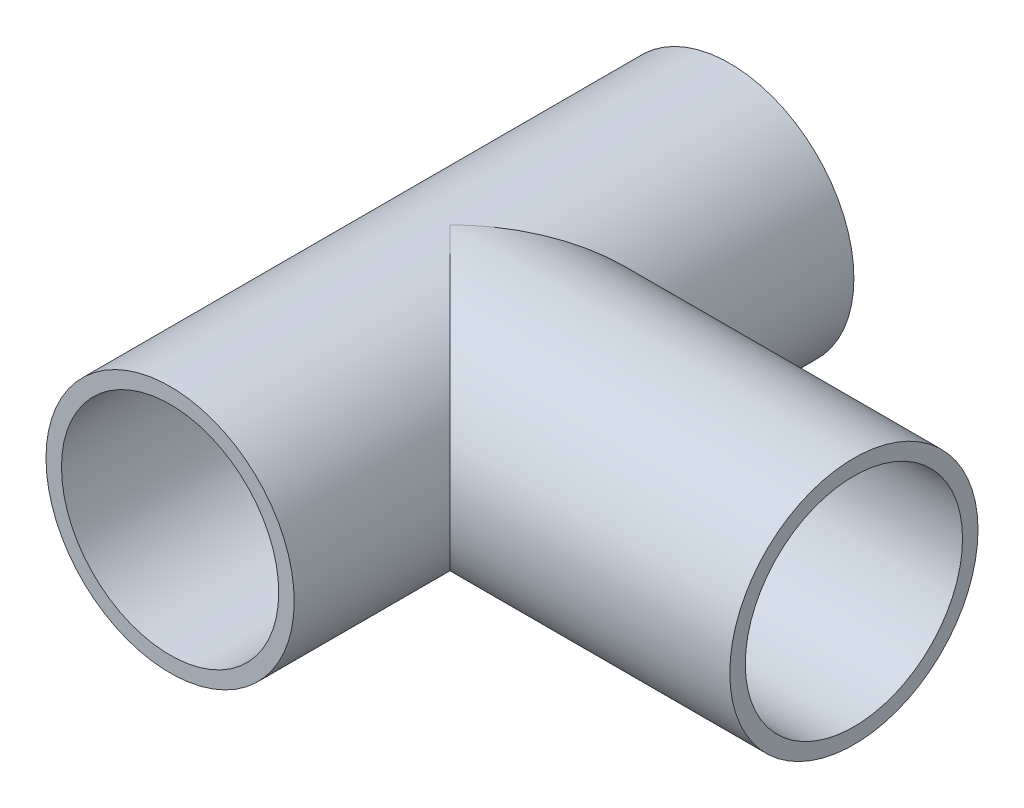
ISO-10303-21;
HEADER;
FILE_DESCRIPTION(('STEP AP214'),'2;1');
FILE_NAME('part.step','',(''),(''),'','','');
FILE_SCHEMA(('AUTOMOTIVE_DESIGN { 1 0 10303 214 1 1 1 1 }'));
ENDSEC;
DATA;
#1=APPLICATION_CONTEXT('core data for automotive mechanical design processes');
#2=APPLICATION_PROTOCOL_DEFINITION('international standard','automotive_design',2000,#1);
#3=PRODUCT_CONTEXT('',#1,'mechanical');
#4=PRODUCT('Part','Part','',(#3));
#5=PRODUCT_RELATED_PRODUCT_CATEGORY('part','',(#4));
#6=PRODUCT_DEFINITION_FORMATION('','',#4);
#7=PRODUCT_DEFINITION_CONTEXT('part definition',#1,'design');
#8=PRODUCT_DEFINITION('design','',#6,#7);
#9=PRODUCT_DEFINITION_SHAPE('','',#8);
#10=(LENGTH_UNIT() NAMED_UNIT(*) SI_UNIT(.MILLI.,.METRE.));
#11=(NAMED_UNIT(*) PLANE_ANGLE_UNIT() SI_UNIT($,.RADIAN.));
#12=(NAMED_UNIT(*) SI_UNIT($,.STERADIAN.) SOLID_ANGLE_UNIT());
#13=UNCERTAINTY_MEASURE_WITH_UNIT(LENGTH_MEASURE(1.E-05),#10,'distance_accuracy_value','');
#14=(GEOMETRIC_REPRESENTATION_CONTEXT(3) GLOBAL_UNCERTAINTY_ASSIGNED_CONTEXT((#13)) GLOBAL_UNIT_ASSIGNED_CONTEXT((#10,
#11,#12)) REPRESENTATION_CONTEXT('',''));
#15=CARTESIAN_POINT('',(0.,0.,0.));
#16=DIRECTION('',(0.,0.,1.));
#17=DIRECTION('',(1.,0.,0.));
#18=AXIS2_PLACEMENT_3D('',#15,#16,#17);
#19=CARTESIAN_POINT('',(0.,0.,365.125));
#20=DIRECTION('',(0.,0.,1.));
#21=DIRECTION('',(1.,0.,0.));
#22=AXIS2_PLACEMENT_3D('',#19,#20,#21);
#23=PLANE('',#22);
#24=CARTESIAN_POINT('',(0.,0.,365.125));
#25=DIRECTION('',(0.,0.,1.));
#26=DIRECTION('',(1.,0.,0.));
#27=AXIS2_PLACEMENT_3D('',#24,#25,#26);
#28=CIRCLE('',#27,161.925);
#29=CARTESIAN_POINT('',(161.925,0.,365.125));
#30=VERTEX_POINT('',#29);
#31=EDGE_CURVE('E11',#30,#30,#28,.T.);
#32=ORIENTED_EDGE('',*,*,#31,.T.);
#33=EDGE_LOOP('',(#32));
#34=FACE_BOUND('',#33,.T.);
#35=CARTESIAN_POINT('',(0.,0.,365.125));
#36=DIRECTION('',(0.,0.,1.));
#37=DIRECTION('',(1.,0.,0.));
#38=AXIS2_PLACEMENT_3D('',#35,#36,#37);
#39=CIRCLE('',#38,141.732);
#40=CARTESIAN_POINT('',(141.732,0.,365.125));
#41=VERTEX_POINT('',#40);
#42=EDGE_CURVE('E84',#41,#41,#39,.T.);
#43=ORIENTED_EDGE('',*,*,#42,.F.);
#44=EDGE_LOOP('',(#43));
#45=FACE_BOUND('',#44,.T.);
#46=ADVANCED_FACE('F40',(#34,#45),#23,.T.);
#47=CARTESIAN_POINT('',(0.,0.,-365.125));
#48=DIRECTION('',(0.,0.,1.));
#49=DIRECTION('',(1.,0.,0.));
#50=AXIS2_PLACEMENT_3D('',#47,#48,#49);
#51=PLANE('',#50);
#52=CARTESIAN_POINT('',(0.,0.,-365.125));
#53=DIRECTION('',(0.,0.,1.));
#54=DIRECTION('',(1.,0.,0.));
#55=AXIS2_PLACEMENT_3D('',#52,#53,#54);
#56=CIRCLE('',#55,161.925);
#57=CARTESIAN_POINT('',(161.925,0.,-365.125));
#58=VERTEX_POINT('',#57);
#59=EDGE_CURVE('E44',#58,#58,#56,.T.);
#60=ORIENTED_EDGE('',*,*,#59,.F.);
#61=EDGE_LOOP('',(#60));
#62=FACE_BOUND('',#61,.T.);
#63=CARTESIAN_POINT('',(0.,0.,-365.125));
#64=DIRECTION('',(0.,0.,1.));
#65=DIRECTION('',(1.,0.,0.));
#66=AXIS2_PLACEMENT_3D('',#63,#64,#65);
#67=CIRCLE('',#66,141.732);
#68=CARTESIAN_POINT('',(141.732,0.,-365.125));
#69=VERTEX_POINT('',#68);
#70=EDGE_CURVE('E82',#69,#69,#67,.T.);
#71=ORIENTED_EDGE('',*,*,#70,.T.);
#72=EDGE_LOOP('',(#71));
#73=FACE_BOUND('',#72,.T.);
#74=ADVANCED_FACE('F90',(#62,#73),#51,.F.);
#75=CARTESIAN_POINT('',(0.,0.,365.125));
#76=DIRECTION('',(0.,0.,-1.));
#77=DIRECTION('',(-1.,0.,0.));
#78=AXIS2_PLACEMENT_3D('',#75,#76,#77);
#79=CYLINDRICAL_SURFACE('',#78,161.925);
#80=CARTESIAN_POINT('',(0.,0.,0.));
#81=DIRECTION('',(0.707106781186547,0.,0.707106781186547));
#82=DIRECTION('',(0.707106781186547,0.,-0.707106781186547));
#83=AXIS2_PLACEMENT_3D('',#80,#81,#82);
#84=ELLIPSE('',#83,228.996531087264,161.925);
#85=CARTESIAN_POINT('',(0.,-161.925,0.));
#86=VERTEX_POINT('',#85);
#87=CARTESIAN_POINT('',(0.,161.925,0.));
#88=VERTEX_POINT('',#87);
#89=EDGE_CURVE('E74',#86,#88,#84,.T.);
#90=ORIENTED_EDGE('',*,*,#89,.F.);
#91=CARTESIAN_POINT('',(0.,0.,0.));
#92=DIRECTION('',(0.707106781186547,0.,-0.707106781186547));
#93=DIRECTION('',(0.707106781186547,0.,0.707106781186547));
#94=AXIS2_PLACEMENT_3D('',#91,#92,#93);
#95=ELLIPSE('',#94,228.996531087264,161.925);
#96=EDGE_CURVE('E61',#88,#86,#95,.T.);
#97=ORIENTED_EDGE('',*,*,#96,.F.);
#98=EDGE_LOOP('',(#90,#97));
#99=FACE_BOUND('',#98,.T.);
#100=ORIENTED_EDGE('',*,*,#31,.F.);
#101=EDGE_LOOP('',(#100));
#102=FACE_BOUND('',#101,.T.);
#103=ORIENTED_EDGE('',*,*,#59,.T.);
#104=EDGE_LOOP('',(#103));
#105=FACE_BOUND('',#104,.T.);
#106=ADVANCED_FACE('F42',(#99,#102,#105),#79,.T.);
#107=CARTESIAN_POINT('',(0.,0.,365.125));
#108=DIRECTION('',(0.,0.,-1.));
#109=DIRECTION('',(-1.,0.,0.));
#110=AXIS2_PLACEMENT_3D('',#107,#108,#109);
#111=CYLINDRICAL_SURFACE('',#110,141.732);
#112=CARTESIAN_POINT('',(0.,0.,0.));
#113=DIRECTION('',(0.707106781186547,0.,-0.707106781186547));
#114=DIRECTION('',(-0.707106781186547,0.,-0.707106781186547));
#115=AXIS2_PLACEMENT_3D('',#112,#113,#114);
#116=ELLIPSE('',#115,200.439316622264,141.732);
#117=CARTESIAN_POINT('',(0.,-141.732,0.));
#118=VERTEX_POINT('',#117);
#119=CARTESIAN_POINT('',(0.,141.732,0.));
#120=VERTEX_POINT('',#119);
#121=EDGE_CURVE('E54',#118,#120,#116,.F.);
#122=ORIENTED_EDGE('',*,*,#121,.F.);
#123=CARTESIAN_POINT('',(0.,0.,0.));
#124=DIRECTION('',(-0.707106781186547,0.,-0.707106781186547));
#125=DIRECTION('',(0.707106781186547,0.,-0.707106781186547));
#126=AXIS2_PLACEMENT_3D('',#123,#124,#125);
#127=ELLIPSE('',#126,200.439316622264,141.732);
#128=EDGE_CURVE('E66',#120,#118,#127,.T.);
#129=ORIENTED_EDGE('',*,*,#128,.F.);
#130=EDGE_LOOP('',(#122,#129));
#131=FACE_BOUND('',#130,.T.);
#132=ORIENTED_EDGE('',*,*,#42,.T.);
#133=EDGE_LOOP('',(#132));
#134=FACE_BOUND('',#133,.T.);
#135=ORIENTED_EDGE('',*,*,#70,.F.);
#136=EDGE_LOOP('',(#135));
#137=FACE_BOUND('',#136,.T.);
#138=ADVANCED_FACE('F72',(#131,#134,#137),#111,.F.);
#139=CARTESIAN_POINT('',(-161.926,0.,0.));
#140=DIRECTION('',(1.,0.,0.));
#141=DIRECTION('',(0.,0.,-1.));
#142=AXIS2_PLACEMENT_3D('',#139,#140,#141);
#143=CYLINDRICAL_SURFACE('',#142,161.925);
#144=CARTESIAN_POINT('',(527.05,0.,0.));
#145=DIRECTION('',(1.,0.,0.));
#146=DIRECTION('',(0.,0.,-1.));
#147=AXIS2_PLACEMENT_3D('',#144,#145,#146);
#148=CIRCLE('',#147,161.925);
#149=CARTESIAN_POINT('',(527.05,0.,-161.925));
#150=VERTEX_POINT('',#149);
#151=EDGE_CURVE('E80',#150,#150,#148,.T.);
#152=ORIENTED_EDGE('',*,*,#151,.F.);
#153=EDGE_LOOP('',(#152));
#154=FACE_BOUND('',#153,.T.);
#155=ORIENTED_EDGE('',*,*,#89,.T.);
#156=ORIENTED_EDGE('',*,*,#96,.T.);
#157=EDGE_LOOP('',(#155,#156));
#158=FACE_BOUND('',#157,.T.);
#159=ADVANCED_FACE('F93',(#154,#158),#143,.T.);
#160=CARTESIAN_POINT('',(527.05,0.,0.));
#161=DIRECTION('',(1.,0.,0.));
#162=DIRECTION('',(0.,0.,-1.));
#163=AXIS2_PLACEMENT_3D('',#160,#161,#162);
#164=PLANE('',#163);
#165=CARTESIAN_POINT('',(527.05,0.,0.));
#166=DIRECTION('',(1.,0.,0.));
#167=DIRECTION('',(0.,0.,-1.));
#168=AXIS2_PLACEMENT_3D('',#165,#166,#167);
#169=CIRCLE('',#168,141.732);
#170=CARTESIAN_POINT('',(527.05,0.,-141.732));
#171=VERTEX_POINT('',#170);
#172=EDGE_CURVE('E70',#171,#171,#169,.T.);
#173=ORIENTED_EDGE('',*,*,#172,.F.);
#174=EDGE_LOOP('',(#173));
#175=FACE_BOUND('',#174,.T.);
#176=ORIENTED_EDGE('',*,*,#151,.T.);
#177=EDGE_LOOP('',(#176));
#178=FACE_BOUND('',#177,.T.);
#179=ADVANCED_FACE('F99',(#175,#178),#164,.T.);
#180=CARTESIAN_POINT('',(-400.878633244527,0.,0.));
#181=DIRECTION('',(1.,0.,0.));
#182=DIRECTION('',(0.,0.,-1.));
#183=AXIS2_PLACEMENT_3D('',#180,#181,#182);
#184=CYLINDRICAL_SURFACE('',#183,141.732);
#185=ORIENTED_EDGE('',*,*,#121,.T.);
#186=ORIENTED_EDGE('',*,*,#128,.T.);
#187=EDGE_LOOP('',(#185,#186));
#188=FACE_BOUND('',#187,.T.);
#189=ORIENTED_EDGE('',*,*,#172,.T.);
#190=EDGE_LOOP('',(#189));
#191=FACE_BOUND('',#190,.T.);
#192=ADVANCED_FACE('F67',(#188,#191),#184,.F.);
#193=CLOSED_SHELL('',(#46,#74,#106,#138,#159,#179,#192));
#194=MANIFOLD_SOLID_BREP('B2',#193);
#195=ADVANCED_BREP_SHAPE_REPRESENTATION('',(#18,#194),#14);
#196=SHAPE_DEFINITION_REPRESENTATION(#9,#195);
ENDSEC;
END-ISO-10303-21;
